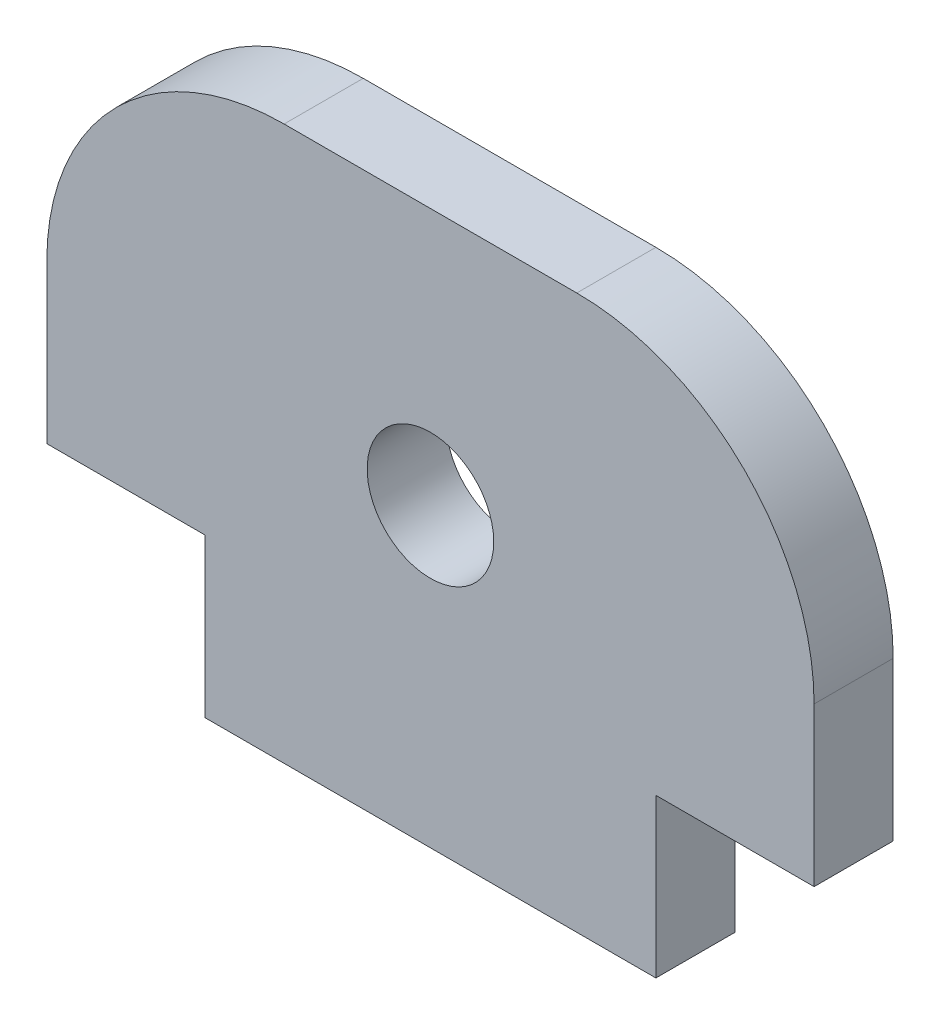
ISO-10303-21;
HEADER;
FILE_DESCRIPTION(('STEP AP214'),'2;1');
FILE_NAME('part.step','',(''),(''),'','','');
FILE_SCHEMA(('AUTOMOTIVE_DESIGN { 1 0 10303 214 1 1 1 1 }'));
ENDSEC;
DATA;
#1=APPLICATION_CONTEXT('core data for automotive mechanical design processes');
#2=APPLICATION_PROTOCOL_DEFINITION('international standard','automotive_design',2000,#1);
#3=PRODUCT_CONTEXT('',#1,'mechanical');
#4=PRODUCT('Part','Part','',(#3));
#5=PRODUCT_RELATED_PRODUCT_CATEGORY('part','',(#4));
#6=PRODUCT_DEFINITION_FORMATION('','',#4);
#7=PRODUCT_DEFINITION_CONTEXT('part definition',#1,'design');
#8=PRODUCT_DEFINITION('design','',#6,#7);
#9=PRODUCT_DEFINITION_SHAPE('','',#8);
#10=(LENGTH_UNIT() NAMED_UNIT(*) SI_UNIT(.MILLI.,.METRE.));
#11=(NAMED_UNIT(*) PLANE_ANGLE_UNIT() SI_UNIT($,.RADIAN.));
#12=(NAMED_UNIT(*) SI_UNIT($,.STERADIAN.) SOLID_ANGLE_UNIT());
#13=UNCERTAINTY_MEASURE_WITH_UNIT(LENGTH_MEASURE(1.E-05),#10,'distance_accuracy_value','');
#14=(GEOMETRIC_REPRESENTATION_CONTEXT(3) GLOBAL_UNCERTAINTY_ASSIGNED_CONTEXT((#13)) GLOBAL_UNIT_ASSIGNED_CONTEXT((#10,
#11,#12)) REPRESENTATION_CONTEXT('',''));
#15=CARTESIAN_POINT('',(0.,0.,0.));
#16=DIRECTION('',(0.,0.,1.));
#17=DIRECTION('',(1.,0.,0.));
#18=AXIS2_PLACEMENT_3D('',#15,#16,#17);
#19=CARTESIAN_POINT('',(3.70000000000048,8.,2.));
#20=DIRECTION('',(0.,0.,1.));
#21=DIRECTION('',(1.,0.,0.));
#22=AXIS2_PLACEMENT_3D('',#19,#20,#21);
#23=PLANE('',#22);
#24=CARTESIAN_POINT('',(3.70000000000048,8.,2.));
#25=DIRECTION('',(0.,0.,1.));
#26=DIRECTION('',(1.,0.,0.));
#27=AXIS2_PLACEMENT_3D('',#24,#25,#26);
#28=CIRCLE('',#27,5.99999999999978);
#29=CARTESIAN_POINT('',(9.70000000000026,8.,2.));
#30=VERTEX_POINT('',#29);
#31=CARTESIAN_POINT('',(3.70000000000048,13.9999999999998,2.));
#32=VERTEX_POINT('',#31);
#33=EDGE_CURVE('E160',#30,#32,#28,.T.);
#34=ORIENTED_EDGE('',*,*,#33,.T.);
#35=DIRECTION('',(-1.,0.,0.));
#36=VECTOR('',#35,1.);
#37=CARTESIAN_POINT('',(-3.70000000000048,13.9999999999998,2.));
#38=LINE('',#37,#36);
#39=CARTESIAN_POINT('',(-3.70000000000048,13.9999999999998,2.));
#40=VERTEX_POINT('',#39);
#41=EDGE_CURVE('E98',#32,#40,#38,.T.);
#42=ORIENTED_EDGE('',*,*,#41,.T.);
#43=CARTESIAN_POINT('',(-3.70000000000048,8.,2.));
#44=DIRECTION('',(0.,0.,1.));
#45=DIRECTION('',(1.,0.,0.));
#46=AXIS2_PLACEMENT_3D('',#43,#44,#45);
#47=CIRCLE('',#46,5.99999999999978);
#48=CARTESIAN_POINT('',(-9.70000000000026,8.,2.));
#49=VERTEX_POINT('',#48);
#50=EDGE_CURVE('E181',#40,#49,#47,.T.);
#51=ORIENTED_EDGE('',*,*,#50,.T.);
#52=DIRECTION('',(0.,-1.,0.));
#53=VECTOR('',#52,1.);
#54=CARTESIAN_POINT('',(-9.70000000000026,4.,2.));
#55=LINE('',#54,#53);
#56=CARTESIAN_POINT('',(-9.70000000000026,4.,2.));
#57=VERTEX_POINT('',#56);
#58=EDGE_CURVE('E200',#49,#57,#55,.T.);
#59=ORIENTED_EDGE('',*,*,#58,.T.);
#60=DIRECTION('',(1.,0.,0.));
#61=VECTOR('',#60,1.);
#62=CARTESIAN_POINT('',(-9.70000000000026,4.,2.));
#63=LINE('',#62,#61);
#64=CARTESIAN_POINT('',(-5.70000000000026,4.,2.));
#65=VERTEX_POINT('',#64);
#66=EDGE_CURVE('E197',#57,#65,#63,.T.);
#67=ORIENTED_EDGE('',*,*,#66,.T.);
#68=DIRECTION('',(0.,-1.,0.));
#69=VECTOR('',#68,1.);
#70=CARTESIAN_POINT('',(-5.70000000000026,0.,2.));
#71=LINE('',#70,#69);
#72=CARTESIAN_POINT('',(-5.70000000000026,0.,2.));
#73=VERTEX_POINT('',#72);
#74=EDGE_CURVE('E199',#65,#73,#71,.T.);
#75=ORIENTED_EDGE('',*,*,#74,.T.);
#76=DIRECTION('',(1.,0.,0.));
#77=VECTOR('',#76,1.);
#78=CARTESIAN_POINT('',(5.70000000000026,0.,2.));
#79=LINE('',#78,#77);
#80=CARTESIAN_POINT('',(5.70000000000026,0.,2.));
#81=VERTEX_POINT('',#80);
#82=EDGE_CURVE('E123',#73,#81,#79,.T.);
#83=ORIENTED_EDGE('',*,*,#82,.T.);
#84=DIRECTION('',(0.,1.,0.));
#85=VECTOR('',#84,1.);
#86=CARTESIAN_POINT('',(5.70000000000026,4.,2.));
#87=LINE('',#86,#85);
#88=CARTESIAN_POINT('',(5.70000000000026,4.,2.));
#89=VERTEX_POINT('',#88);
#90=EDGE_CURVE('E117',#81,#89,#87,.T.);
#91=ORIENTED_EDGE('',*,*,#90,.T.);
#92=DIRECTION('',(1.,0.,0.));
#93=VECTOR('',#92,1.);
#94=CARTESIAN_POINT('',(9.70000000000026,4.,2.));
#95=LINE('',#94,#93);
#96=CARTESIAN_POINT('',(9.70000000000026,4.,2.));
#97=VERTEX_POINT('',#96);
#98=EDGE_CURVE('E121',#89,#97,#95,.T.);
#99=ORIENTED_EDGE('',*,*,#98,.T.);
#100=DIRECTION('',(0.,1.,0.));
#101=VECTOR('',#100,1.);
#102=CARTESIAN_POINT('',(9.70000000000026,4.,2.));
#103=LINE('',#102,#101);
#104=EDGE_CURVE('E49',#97,#30,#103,.T.);
#105=ORIENTED_EDGE('',*,*,#104,.T.);
#106=EDGE_LOOP('',(#34,#42,#51,#59,#67,#75,#83,#91,#99,#105));
#107=FACE_BOUND('',#106,.T.);
#108=CARTESIAN_POINT('',(0.,7.5,2.));
#109=DIRECTION('',(0.,0.,1.));
#110=DIRECTION('',(1.,0.,0.));
#111=AXIS2_PLACEMENT_3D('',#108,#109,#110);
#112=CIRCLE('',#111,1.6);
#113=CARTESIAN_POINT('',(1.6,7.5,2.));
#114=VERTEX_POINT('',#113);
#115=EDGE_CURVE('E145',#114,#114,#112,.T.);
#116=ORIENTED_EDGE('',*,*,#115,.F.);
#117=EDGE_LOOP('',(#116));
#118=FACE_BOUND('',#117,.T.);
#119=ADVANCED_FACE('F32',(#107,#118),#23,.T.);
#120=CARTESIAN_POINT('',(3.70000000000048,8.,0.));
#121=DIRECTION('',(0.,0.,1.));
#122=DIRECTION('',(1.,0.,0.));
#123=AXIS2_PLACEMENT_3D('',#120,#121,#122);
#124=PLANE('',#123);
#125=CARTESIAN_POINT('',(3.70000000000048,8.,0.));
#126=DIRECTION('',(0.,0.,1.));
#127=DIRECTION('',(1.,0.,0.));
#128=AXIS2_PLACEMENT_3D('',#125,#126,#127);
#129=CIRCLE('',#128,5.99999999999978);
#130=CARTESIAN_POINT('',(9.70000000000026,8.,0.));
#131=VERTEX_POINT('',#130);
#132=CARTESIAN_POINT('',(3.70000000000048,13.9999999999998,0.));
#133=VERTEX_POINT('',#132);
#134=EDGE_CURVE('E141',#131,#133,#129,.T.);
#135=ORIENTED_EDGE('',*,*,#134,.F.);
#136=DIRECTION('',(0.,1.,0.));
#137=VECTOR('',#136,1.);
#138=CARTESIAN_POINT('',(9.70000000000026,4.,0.));
#139=LINE('',#138,#137);
#140=CARTESIAN_POINT('',(9.70000000000026,4.,0.));
#141=VERTEX_POINT('',#140);
#142=EDGE_CURVE('E90',#141,#131,#139,.T.);
#143=ORIENTED_EDGE('',*,*,#142,.F.);
#144=DIRECTION('',(1.,0.,0.));
#145=VECTOR('',#144,1.);
#146=CARTESIAN_POINT('',(9.70000000000026,4.,0.));
#147=LINE('',#146,#145);
#148=CARTESIAN_POINT('',(5.70000000000026,4.,0.));
#149=VERTEX_POINT('',#148);
#150=EDGE_CURVE('E84',#149,#141,#147,.T.);
#151=ORIENTED_EDGE('',*,*,#150,.F.);
#152=DIRECTION('',(0.,1.,0.));
#153=VECTOR('',#152,1.);
#154=CARTESIAN_POINT('',(5.70000000000026,4.,0.));
#155=LINE('',#154,#153);
#156=CARTESIAN_POINT('',(5.70000000000026,0.,0.));
#157=VERTEX_POINT('',#156);
#158=EDGE_CURVE('E131',#157,#149,#155,.T.);
#159=ORIENTED_EDGE('',*,*,#158,.F.);
#160=DIRECTION('',(1.,0.,0.));
#161=VECTOR('',#160,1.);
#162=CARTESIAN_POINT('',(5.70000000000026,0.,0.));
#163=LINE('',#162,#161);
#164=CARTESIAN_POINT('',(-5.70000000000026,0.,0.));
#165=VERTEX_POINT('',#164);
#166=EDGE_CURVE('E155',#165,#157,#163,.T.);
#167=ORIENTED_EDGE('',*,*,#166,.F.);
#168=DIRECTION('',(0.,-1.,0.));
#169=VECTOR('',#168,1.);
#170=CARTESIAN_POINT('',(-5.70000000000026,0.,0.));
#171=LINE('',#170,#169);
#172=CARTESIAN_POINT('',(-5.70000000000026,4.,0.));
#173=VERTEX_POINT('',#172);
#174=EDGE_CURVE('E153',#173,#165,#171,.T.);
#175=ORIENTED_EDGE('',*,*,#174,.F.);
#176=DIRECTION('',(1.,0.,0.));
#177=VECTOR('',#176,1.);
#178=CARTESIAN_POINT('',(-9.70000000000026,4.,0.));
#179=LINE('',#178,#177);
#180=CARTESIAN_POINT('',(-9.70000000000026,4.,0.));
#181=VERTEX_POINT('',#180);
#182=EDGE_CURVE('E151',#181,#173,#179,.T.);
#183=ORIENTED_EDGE('',*,*,#182,.F.);
#184=DIRECTION('',(0.,-1.,0.));
#185=VECTOR('',#184,1.);
#186=CARTESIAN_POINT('',(-9.70000000000026,4.,0.));
#187=LINE('',#186,#185);
#188=CARTESIAN_POINT('',(-9.70000000000026,8.,0.));
#189=VERTEX_POINT('',#188);
#190=EDGE_CURVE('E149',#189,#181,#187,.T.);
#191=ORIENTED_EDGE('',*,*,#190,.F.);
#192=CARTESIAN_POINT('',(-3.70000000000048,8.,0.));
#193=DIRECTION('',(0.,0.,1.));
#194=DIRECTION('',(1.,0.,0.));
#195=AXIS2_PLACEMENT_3D('',#192,#193,#194);
#196=CIRCLE('',#195,5.99999999999978);
#197=CARTESIAN_POINT('',(-3.70000000000048,13.9999999999998,0.));
#198=VERTEX_POINT('',#197);
#199=EDGE_CURVE('E147',#198,#189,#196,.T.);
#200=ORIENTED_EDGE('',*,*,#199,.F.);
#201=DIRECTION('',(-1.,0.,0.));
#202=VECTOR('',#201,1.);
#203=CARTESIAN_POINT('',(-3.70000000000048,13.9999999999998,0.));
#204=LINE('',#203,#202);
#205=EDGE_CURVE('E144',#133,#198,#204,.T.);
#206=ORIENTED_EDGE('',*,*,#205,.F.);
#207=EDGE_LOOP('',(#135,#143,#151,#159,#167,#175,#183,#191,#200,#206));
#208=FACE_BOUND('',#207,.T.);
#209=CARTESIAN_POINT('',(0.,7.5,0.));
#210=DIRECTION('',(0.,0.,1.));
#211=DIRECTION('',(1.,0.,0.));
#212=AXIS2_PLACEMENT_3D('',#209,#210,#211);
#213=CIRCLE('',#212,1.6);
#214=CARTESIAN_POINT('',(1.6,7.5,0.));
#215=VERTEX_POINT('',#214);
#216=EDGE_CURVE('E208',#215,#215,#213,.T.);
#217=ORIENTED_EDGE('',*,*,#216,.T.);
#218=EDGE_LOOP('',(#217));
#219=FACE_BOUND('',#218,.T.);
#220=ADVANCED_FACE('F185',(#208,#219),#124,.F.);
#221=CARTESIAN_POINT('',(3.70000000000048,8.,2.));
#222=DIRECTION('',(0.,0.,-1.));
#223=DIRECTION('',(-1.,0.,0.));
#224=AXIS2_PLACEMENT_3D('',#221,#222,#223);
#225=CYLINDRICAL_SURFACE('',#224,5.99999999999978);
#226=ORIENTED_EDGE('',*,*,#134,.T.);
#227=DIRECTION('',(0.,0.,-1.));
#228=VECTOR('',#227,1.);
#229=CARTESIAN_POINT('',(3.70000000000048,13.9999999999998,2.));
#230=LINE('',#229,#228);
#231=EDGE_CURVE('E11',#32,#133,#230,.T.);
#232=ORIENTED_EDGE('',*,*,#231,.F.);
#233=ORIENTED_EDGE('',*,*,#33,.F.);
#234=DIRECTION('',(0.,0.,-1.));
#235=VECTOR('',#234,1.);
#236=CARTESIAN_POINT('',(9.70000000000026,8.,2.));
#237=LINE('',#236,#235);
#238=EDGE_CURVE('E137',#30,#131,#237,.T.);
#239=ORIENTED_EDGE('',*,*,#238,.T.);
#240=EDGE_LOOP('',(#226,#232,#233,#239));
#241=FACE_BOUND('',#240,.T.);
#242=ADVANCED_FACE('F34',(#241),#225,.T.);
#243=CARTESIAN_POINT('',(-3.70000000000048,13.9999999999998,2.));
#244=DIRECTION('',(0.,-1.,0.));
#245=DIRECTION('',(0.,0.,-1.));
#246=AXIS2_PLACEMENT_3D('',#243,#244,#245);
#247=PLANE('',#246);
#248=ORIENTED_EDGE('',*,*,#205,.T.);
#249=DIRECTION('',(0.,0.,-1.));
#250=VECTOR('',#249,1.);
#251=CARTESIAN_POINT('',(-3.70000000000048,13.9999999999998,2.));
#252=LINE('',#251,#250);
#253=EDGE_CURVE('E41',#40,#198,#252,.T.);
#254=ORIENTED_EDGE('',*,*,#253,.F.);
#255=ORIENTED_EDGE('',*,*,#41,.F.);
#256=ORIENTED_EDGE('',*,*,#231,.T.);
#257=EDGE_LOOP('',(#248,#254,#255,#256));
#258=FACE_BOUND('',#257,.T.);
#259=ADVANCED_FACE('F244',(#258),#247,.F.);
#260=CARTESIAN_POINT('',(-3.70000000000048,8.,2.));
#261=DIRECTION('',(0.,0.,-1.));
#262=DIRECTION('',(-1.,0.,0.));
#263=AXIS2_PLACEMENT_3D('',#260,#261,#262);
#264=CYLINDRICAL_SURFACE('',#263,5.99999999999978);
#265=ORIENTED_EDGE('',*,*,#199,.T.);
#266=DIRECTION('',(0.,0.,-1.));
#267=VECTOR('',#266,1.);
#268=CARTESIAN_POINT('',(-9.70000000000026,8.,2.));
#269=LINE('',#268,#267);
#270=EDGE_CURVE('E173',#49,#189,#269,.T.);
#271=ORIENTED_EDGE('',*,*,#270,.F.);
#272=ORIENTED_EDGE('',*,*,#50,.F.);
#273=ORIENTED_EDGE('',*,*,#253,.T.);
#274=EDGE_LOOP('',(#265,#271,#272,#273));
#275=FACE_BOUND('',#274,.T.);
#276=ADVANCED_FACE('F179',(#275),#264,.T.);
#277=CARTESIAN_POINT('',(-9.70000000000026,4.,2.));
#278=DIRECTION('',(1.,0.,0.));
#279=DIRECTION('',(0.,0.,-1.));
#280=AXIS2_PLACEMENT_3D('',#277,#278,#279);
#281=PLANE('',#280);
#282=ORIENTED_EDGE('',*,*,#190,.T.);
#283=DIRECTION('',(0.,0.,-1.));
#284=VECTOR('',#283,1.);
#285=CARTESIAN_POINT('',(-9.70000000000026,4.,2.));
#286=LINE('',#285,#284);
#287=EDGE_CURVE('E170',#57,#181,#286,.T.);
#288=ORIENTED_EDGE('',*,*,#287,.F.);
#289=ORIENTED_EDGE('',*,*,#58,.F.);
#290=ORIENTED_EDGE('',*,*,#270,.T.);
#291=EDGE_LOOP('',(#282,#288,#289,#290));
#292=FACE_BOUND('',#291,.T.);
#293=ADVANCED_FACE('F191',(#292),#281,.F.);
#294=CARTESIAN_POINT('',(-9.70000000000026,4.,2.));
#295=DIRECTION('',(0.,1.,0.));
#296=DIRECTION('',(0.,0.,1.));
#297=AXIS2_PLACEMENT_3D('',#294,#295,#296);
#298=PLANE('',#297);
#299=ORIENTED_EDGE('',*,*,#182,.T.);
#300=DIRECTION('',(0.,0.,-1.));
#301=VECTOR('',#300,1.);
#302=CARTESIAN_POINT('',(-5.70000000000026,4.,2.));
#303=LINE('',#302,#301);
#304=EDGE_CURVE('E167',#65,#173,#303,.T.);
#305=ORIENTED_EDGE('',*,*,#304,.F.);
#306=ORIENTED_EDGE('',*,*,#66,.F.);
#307=ORIENTED_EDGE('',*,*,#287,.T.);
#308=EDGE_LOOP('',(#299,#305,#306,#307));
#309=FACE_BOUND('',#308,.T.);
#310=ADVANCED_FACE('F195',(#309),#298,.F.);
#311=CARTESIAN_POINT('',(-5.70000000000026,0.,2.));
#312=DIRECTION('',(1.,0.,0.));
#313=DIRECTION('',(0.,0.,-1.));
#314=AXIS2_PLACEMENT_3D('',#311,#312,#313);
#315=PLANE('',#314);
#316=ORIENTED_EDGE('',*,*,#174,.T.);
#317=DIRECTION('',(0.,0.,-1.));
#318=VECTOR('',#317,1.);
#319=CARTESIAN_POINT('',(-5.70000000000026,0.,2.));
#320=LINE('',#319,#318);
#321=EDGE_CURVE('E164',#73,#165,#320,.T.);
#322=ORIENTED_EDGE('',*,*,#321,.F.);
#323=ORIENTED_EDGE('',*,*,#74,.F.);
#324=ORIENTED_EDGE('',*,*,#304,.T.);
#325=EDGE_LOOP('',(#316,#322,#323,#324));
#326=FACE_BOUND('',#325,.T.);
#327=ADVANCED_FACE('F234',(#326),#315,.F.);
#328=CARTESIAN_POINT('',(5.70000000000026,0.,2.));
#329=DIRECTION('',(0.,1.,0.));
#330=DIRECTION('',(0.,0.,1.));
#331=AXIS2_PLACEMENT_3D('',#328,#329,#330);
#332=PLANE('',#331);
#333=ORIENTED_EDGE('',*,*,#166,.T.);
#334=DIRECTION('',(0.,0.,-1.));
#335=VECTOR('',#334,1.);
#336=CARTESIAN_POINT('',(5.70000000000026,0.,2.));
#337=LINE('',#336,#335);
#338=EDGE_CURVE('E132',#81,#157,#337,.T.);
#339=ORIENTED_EDGE('',*,*,#338,.F.);
#340=ORIENTED_EDGE('',*,*,#82,.F.);
#341=ORIENTED_EDGE('',*,*,#321,.T.);
#342=EDGE_LOOP('',(#333,#339,#340,#341));
#343=FACE_BOUND('',#342,.T.);
#344=ADVANCED_FACE('F231',(#343),#332,.F.);
#345=CARTESIAN_POINT('',(5.70000000000026,4.,2.));
#346=DIRECTION('',(-1.,0.,0.));
#347=DIRECTION('',(0.,0.,1.));
#348=AXIS2_PLACEMENT_3D('',#345,#346,#347);
#349=PLANE('',#348);
#350=ORIENTED_EDGE('',*,*,#158,.T.);
#351=DIRECTION('',(0.,0.,-1.));
#352=VECTOR('',#351,1.);
#353=CARTESIAN_POINT('',(5.70000000000026,4.,2.));
#354=LINE('',#353,#352);
#355=EDGE_CURVE('E128',#89,#149,#354,.T.);
#356=ORIENTED_EDGE('',*,*,#355,.F.);
#357=ORIENTED_EDGE('',*,*,#90,.F.);
#358=ORIENTED_EDGE('',*,*,#338,.T.);
#359=EDGE_LOOP('',(#350,#356,#357,#358));
#360=FACE_BOUND('',#359,.T.);
#361=ADVANCED_FACE('F129',(#360),#349,.F.);
#362=CARTESIAN_POINT('',(9.70000000000026,4.,2.));
#363=DIRECTION('',(0.,1.,0.));
#364=DIRECTION('',(0.,0.,1.));
#365=AXIS2_PLACEMENT_3D('',#362,#363,#364);
#366=PLANE('',#365);
#367=ORIENTED_EDGE('',*,*,#150,.T.);
#368=DIRECTION('',(0.,0.,-1.));
#369=VECTOR('',#368,1.);
#370=CARTESIAN_POINT('',(9.70000000000026,4.,2.));
#371=LINE('',#370,#369);
#372=EDGE_CURVE('E133',#97,#141,#371,.T.);
#373=ORIENTED_EDGE('',*,*,#372,.F.);
#374=ORIENTED_EDGE('',*,*,#98,.F.);
#375=ORIENTED_EDGE('',*,*,#355,.T.);
#376=EDGE_LOOP('',(#367,#373,#374,#375));
#377=FACE_BOUND('',#376,.T.);
#378=ADVANCED_FACE('F135',(#377),#366,.F.);
#379=CARTESIAN_POINT('',(9.70000000000026,4.,2.));
#380=DIRECTION('',(-1.,0.,0.));
#381=DIRECTION('',(0.,0.,1.));
#382=AXIS2_PLACEMENT_3D('',#379,#380,#381);
#383=PLANE('',#382);
#384=ORIENTED_EDGE('',*,*,#142,.T.);
#385=ORIENTED_EDGE('',*,*,#238,.F.);
#386=ORIENTED_EDGE('',*,*,#104,.F.);
#387=ORIENTED_EDGE('',*,*,#372,.T.);
#388=EDGE_LOOP('',(#384,#385,#386,#387));
#389=FACE_BOUND('',#388,.T.);
#390=ADVANCED_FACE('F224',(#389),#383,.F.);
#391=CARTESIAN_POINT('',(0.,7.5,2.));
#392=DIRECTION('',(0.,0.,-1.));
#393=DIRECTION('',(-1.,0.,0.));
#394=AXIS2_PLACEMENT_3D('',#391,#392,#393);
#395=CYLINDRICAL_SURFACE('',#394,1.6);
#396=ORIENTED_EDGE('',*,*,#115,.T.);
#397=EDGE_LOOP('',(#396));
#398=FACE_BOUND('',#397,.T.);
#399=ORIENTED_EDGE('',*,*,#216,.F.);
#400=EDGE_LOOP('',(#399));
#401=FACE_BOUND('',#400,.T.);
#402=ADVANCED_FACE('F214',(#398,#401),#395,.F.);
#403=CLOSED_SHELL('',(#119,#220,#242,#259,#276,#293,#310,#327,#344,#361,#378,#390,#402));
#404=MANIFOLD_SOLID_BREP('B2',#403);
#405=ADVANCED_BREP_SHAPE_REPRESENTATION('',(#18,#404),#14);
#406=SHAPE_DEFINITION_REPRESENTATION(#9,#405);
ENDSEC;
END-ISO-10303-21;
